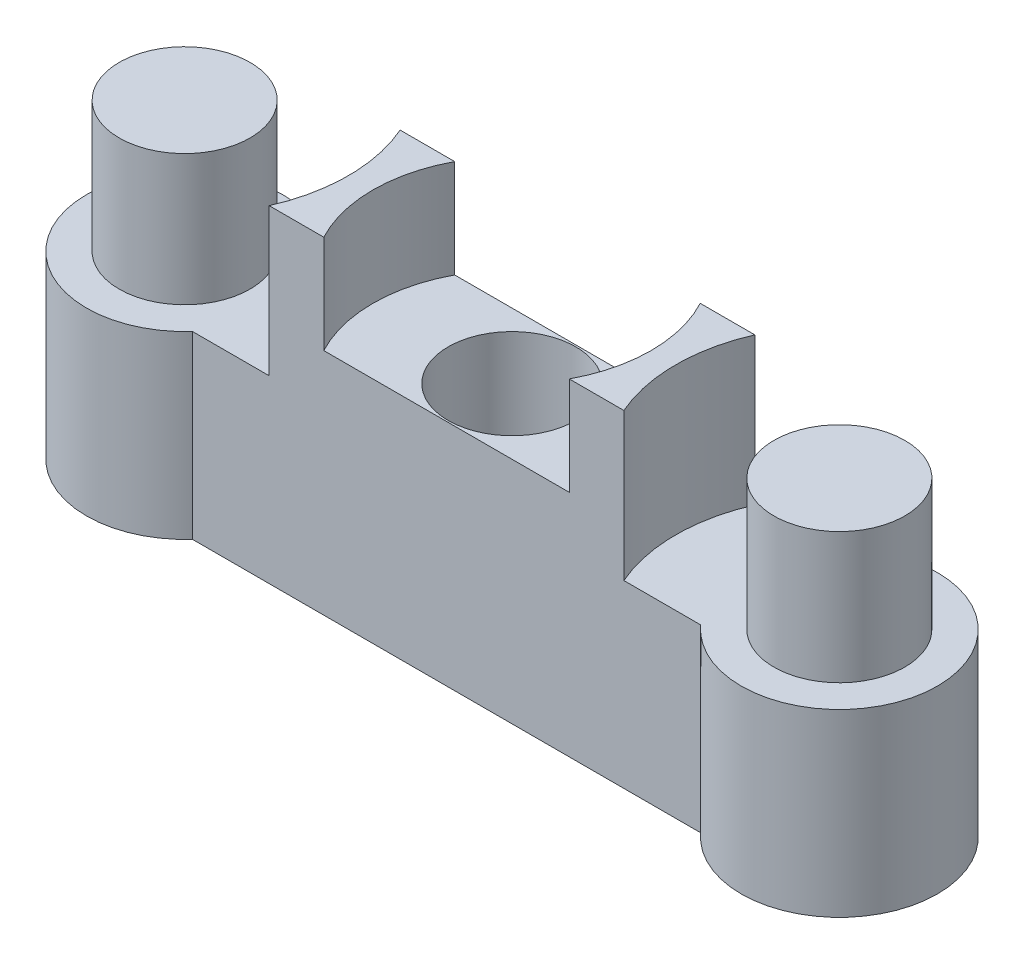
ISO-10303-21;
HEADER;
FILE_DESCRIPTION(('STEP AP214'),'2;1');
FILE_NAME('part.step','',(''),(''),'','','');
FILE_SCHEMA(('AUTOMOTIVE_DESIGN { 1 0 10303 214 1 1 1 1 }'));
ENDSEC;
DATA;
#1=APPLICATION_CONTEXT('core data for automotive mechanical design processes');
#2=APPLICATION_PROTOCOL_DEFINITION('international standard','automotive_design',2000,#1);
#3=PRODUCT_CONTEXT('',#1,'mechanical');
#4=PRODUCT('Part','Part','',(#3));
#5=PRODUCT_RELATED_PRODUCT_CATEGORY('part','',(#4));
#6=PRODUCT_DEFINITION_FORMATION('','',#4);
#7=PRODUCT_DEFINITION_CONTEXT('part definition',#1,'design');
#8=PRODUCT_DEFINITION('design','',#6,#7);
#9=PRODUCT_DEFINITION_SHAPE('','',#8);
#10=(LENGTH_UNIT() NAMED_UNIT(*) SI_UNIT(.MILLI.,.METRE.));
#11=(NAMED_UNIT(*) PLANE_ANGLE_UNIT() SI_UNIT($,.RADIAN.));
#12=(NAMED_UNIT(*) SI_UNIT($,.STERADIAN.) SOLID_ANGLE_UNIT());
#13=UNCERTAINTY_MEASURE_WITH_UNIT(LENGTH_MEASURE(1.E-05),#10,'distance_accuracy_value','');
#14=(GEOMETRIC_REPRESENTATION_CONTEXT(3) GLOBAL_UNCERTAINTY_ASSIGNED_CONTEXT((#13)) GLOBAL_UNIT_ASSIGNED_CONTEXT((#10,
#11,#12)) REPRESENTATION_CONTEXT('',''));
#15=CARTESIAN_POINT('',(0.,0.,0.));
#16=DIRECTION('',(0.,0.,1.));
#17=DIRECTION('',(1.,0.,0.));
#18=AXIS2_PLACEMENT_3D('',#15,#16,#17);
#19=CARTESIAN_POINT('',(-10.,10.,0.));
#20=DIRECTION('',(0.,1.,0.));
#21=DIRECTION('',(0.,0.,1.));
#22=AXIS2_PLACEMENT_3D('',#19,#20,#21);
#23=PLANE('',#22);
#24=CARTESIAN_POINT('',(0.,10.,0.));
#25=DIRECTION('',(0.,1.,0.));
#26=DIRECTION('',(0.,0.,1.));
#27=AXIS2_PLACEMENT_3D('',#24,#25,#26);
#28=CIRCLE('',#27,4.25);
#29=CARTESIAN_POINT('',(3.75,10.,2.));
#30=VERTEX_POINT('',#29);
#31=CARTESIAN_POINT('',(3.75,10.,-2.));
#32=VERTEX_POINT('',#31);
#33=EDGE_CURVE('E133',#30,#32,#28,.T.);
#34=ORIENTED_EDGE('',*,*,#33,.F.);
#35=DIRECTION('',(1.,0.,0.));
#36=VECTOR('',#35,1.);
#37=CARTESIAN_POINT('',(7.76393202250021,10.,2.));
#38=LINE('',#37,#36);
#39=CARTESIAN_POINT('',(5.41742430504417,10.,2.));
#40=VERTEX_POINT('',#39);
#41=EDGE_CURVE('E145',#30,#40,#38,.T.);
#42=ORIENTED_EDGE('',*,*,#41,.T.);
#43=CARTESIAN_POINT('',(10.,10.,0.));
#44=DIRECTION('',(0.,1.,0.));
#45=DIRECTION('',(0.,0.,-1.));
#46=AXIS2_PLACEMENT_3D('',#43,#44,#45);
#47=CIRCLE('',#46,5.);
#48=CARTESIAN_POINT('',(5.41742430504416,10.,-2.));
#49=VERTEX_POINT('',#48);
#50=EDGE_CURVE('E209',#49,#40,#47,.T.);
#51=ORIENTED_EDGE('',*,*,#50,.F.);
#52=DIRECTION('',(-1.,0.,0.));
#53=VECTOR('',#52,1.);
#54=CARTESIAN_POINT('',(7.76393202250021,10.,-2.));
#55=LINE('',#54,#53);
#56=EDGE_CURVE('E147',#49,#32,#55,.T.);
#57=ORIENTED_EDGE('',*,*,#56,.T.);
#58=EDGE_LOOP('',(#34,#42,#51,#57));
#59=FACE_BOUND('',#58,.T.);
#60=ADVANCED_FACE('F36',(#59),#23,.T.);
#61=CARTESIAN_POINT('',(0.,2.,0.));
#62=DIRECTION('',(0.,1.,0.));
#63=DIRECTION('',(0.,0.,1.));
#64=AXIS2_PLACEMENT_3D('',#61,#62,#63);
#65=CYLINDRICAL_SURFACE('',#64,1.95);
#66=CARTESIAN_POINT('',(0.,2.,0.));
#67=DIRECTION('',(0.,1.,0.));
#68=DIRECTION('',(0.,0.,1.));
#69=AXIS2_PLACEMENT_3D('',#66,#67,#68);
#70=CIRCLE('',#69,1.95);
#71=CARTESIAN_POINT('',(0.,2.,1.95));
#72=VERTEX_POINT('',#71);
#73=EDGE_CURVE('E190',#72,#72,#70,.T.);
#74=ORIENTED_EDGE('',*,*,#73,.F.);
#75=EDGE_LOOP('',(#74));
#76=FACE_BOUND('',#75,.T.);
#77=CARTESIAN_POINT('',(0.,7.,0.));
#78=DIRECTION('',(0.,1.,0.));
#79=DIRECTION('',(0.,0.,1.));
#80=AXIS2_PLACEMENT_3D('',#77,#78,#79);
#81=CIRCLE('',#80,1.95);
#82=CARTESIAN_POINT('',(0.,7.,1.95));
#83=VERTEX_POINT('',#82);
#84=EDGE_CURVE('E40',#83,#83,#81,.F.);
#85=ORIENTED_EDGE('',*,*,#84,.F.);
#86=EDGE_LOOP('',(#85));
#87=FACE_BOUND('',#86,.T.);
#88=ADVANCED_FACE('F290',(#76,#87),#65,.F.);
#89=CARTESIAN_POINT('',(0.,0.,0.));
#90=DIRECTION('',(0.,1.,0.));
#91=DIRECTION('',(0.,0.,1.));
#92=AXIS2_PLACEMENT_3D('',#89,#90,#91);
#93=CYLINDRICAL_SURFACE('',#92,1.);
#94=CARTESIAN_POINT('',(0.,0.,0.));
#95=DIRECTION('',(0.,1.,0.));
#96=DIRECTION('',(0.,0.,1.));
#97=AXIS2_PLACEMENT_3D('',#94,#95,#96);
#98=CIRCLE('',#97,1.);
#99=CARTESIAN_POINT('',(0.,0.,1.));
#100=VERTEX_POINT('',#99);
#101=EDGE_CURVE('E189',#100,#100,#98,.T.);
#102=ORIENTED_EDGE('',*,*,#101,.F.);
#103=EDGE_LOOP('',(#102));
#104=FACE_BOUND('',#103,.T.);
#105=CARTESIAN_POINT('',(0.,2.,0.));
#106=DIRECTION('',(0.,1.,0.));
#107=DIRECTION('',(0.,0.,1.));
#108=AXIS2_PLACEMENT_3D('',#105,#106,#107);
#109=CIRCLE('',#108,1.);
#110=CARTESIAN_POINT('',(0.,2.,1.));
#111=VERTEX_POINT('',#110);
#112=EDGE_CURVE('E187',#111,#111,#109,.F.);
#113=ORIENTED_EDGE('',*,*,#112,.F.);
#114=EDGE_LOOP('',(#113));
#115=FACE_BOUND('',#114,.T.);
#116=ADVANCED_FACE('F295',(#104,#115),#93,.F.);
#117=CARTESIAN_POINT('',(-10.,10.,0.));
#118=DIRECTION('',(0.,-1.,0.));
#119=DIRECTION('',(0.,0.,-1.));
#120=AXIS2_PLACEMENT_3D('',#117,#118,#119);
#121=CYLINDRICAL_SURFACE('',#120,3.);
#122=CARTESIAN_POINT('',(-10.,5.5,0.));
#123=DIRECTION('',(0.,1.,0.));
#124=DIRECTION('',(0.,0.,1.));
#125=AXIS2_PLACEMENT_3D('',#122,#123,#124);
#126=CIRCLE('',#125,3.);
#127=CARTESIAN_POINT('',(-7.76393202250021,5.5,-2.));
#128=VERTEX_POINT('',#127);
#129=CARTESIAN_POINT('',(-7.76393202250021,5.5,2.));
#130=VERTEX_POINT('',#129);
#131=EDGE_CURVE('E234',#128,#130,#126,.T.);
#132=ORIENTED_EDGE('',*,*,#131,.F.);
#133=DIRECTION('',(0.,-1.,0.));
#134=VECTOR('',#133,1.);
#135=CARTESIAN_POINT('',(-7.76393202250021,10.,-2.));
#136=LINE('',#135,#134);
#137=CARTESIAN_POINT('',(-7.76393202250021,0.,-2.));
#138=VERTEX_POINT('',#137);
#139=EDGE_CURVE('E168',#128,#138,#136,.T.);
#140=ORIENTED_EDGE('',*,*,#139,.T.);
#141=CARTESIAN_POINT('',(-10.,0.,0.));
#142=DIRECTION('',(0.,1.,0.));
#143=DIRECTION('',(0.,0.,1.));
#144=AXIS2_PLACEMENT_3D('',#141,#142,#143);
#145=CIRCLE('',#144,3.);
#146=CARTESIAN_POINT('',(-7.76393202250021,0.,2.));
#147=VERTEX_POINT('',#146);
#148=EDGE_CURVE('E169',#138,#147,#145,.T.);
#149=ORIENTED_EDGE('',*,*,#148,.T.);
#150=DIRECTION('',(0.,-1.,0.));
#151=VECTOR('',#150,1.);
#152=CARTESIAN_POINT('',(-7.76393202250021,10.,2.));
#153=LINE('',#152,#151);
#154=EDGE_CURVE('E182',#130,#147,#153,.T.);
#155=ORIENTED_EDGE('',*,*,#154,.F.);
#156=EDGE_LOOP('',(#132,#140,#149,#155));
#157=FACE_BOUND('',#156,.T.);
#158=ADVANCED_FACE('F38',(#157),#121,.T.);
#159=CARTESIAN_POINT('',(7.76393202250021,10.,2.));
#160=DIRECTION('',(0.,0.,-1.));
#161=DIRECTION('',(-1.,0.,0.));
#162=AXIS2_PLACEMENT_3D('',#159,#160,#161);
#163=PLANE('',#162);
#164=DIRECTION('',(1.,0.,0.));
#165=VECTOR('',#164,1.);
#166=CARTESIAN_POINT('',(7.76393202250021,7.,2.));
#167=LINE('',#166,#165);
#168=CARTESIAN_POINT('',(-3.75,7.,2.));
#169=VERTEX_POINT('',#168);
#170=CARTESIAN_POINT('',(3.75,7.,2.));
#171=VERTEX_POINT('',#170);
#172=EDGE_CURVE('E269',#169,#171,#167,.T.);
#173=ORIENTED_EDGE('',*,*,#172,.F.);
#174=DIRECTION('',(0.,1.,0.));
#175=VECTOR('',#174,1.);
#176=CARTESIAN_POINT('',(-3.75,7.,2.));
#177=LINE('',#176,#175);
#178=CARTESIAN_POINT('',(-3.75,10.,2.));
#179=VERTEX_POINT('',#178);
#180=EDGE_CURVE('E140',#169,#179,#177,.T.);
#181=ORIENTED_EDGE('',*,*,#180,.T.);
#182=CARTESIAN_POINT('',(-5.41742430504416,10.,2.));
#183=VERTEX_POINT('',#182);
#184=EDGE_CURVE('E155',#183,#179,#38,.T.);
#185=ORIENTED_EDGE('',*,*,#184,.F.);
#186=DIRECTION('',(0.,1.,0.));
#187=VECTOR('',#186,1.);
#188=CARTESIAN_POINT('',(-5.41742430504416,5.5,2.));
#189=LINE('',#188,#187);
#190=CARTESIAN_POINT('',(-5.41742430504416,5.5,2.));
#191=VERTEX_POINT('',#190);
#192=EDGE_CURVE('E227',#183,#191,#189,.F.);
#193=ORIENTED_EDGE('',*,*,#192,.T.);
#194=DIRECTION('',(1.,0.,0.));
#195=VECTOR('',#194,1.);
#196=CARTESIAN_POINT('',(7.76393202250021,5.5,2.));
#197=LINE('',#196,#195);
#198=EDGE_CURVE('E165',#130,#191,#197,.T.);
#199=ORIENTED_EDGE('',*,*,#198,.F.);
#200=ORIENTED_EDGE('',*,*,#154,.T.);
#201=DIRECTION('',(1.,0.,0.));
#202=VECTOR('',#201,1.);
#203=CARTESIAN_POINT('',(7.76393202250021,0.,2.));
#204=LINE('',#203,#202);
#205=CARTESIAN_POINT('',(7.76393202250021,0.,2.));
#206=VERTEX_POINT('',#205);
#207=EDGE_CURVE('E172',#147,#206,#204,.T.);
#208=ORIENTED_EDGE('',*,*,#207,.T.);
#209=DIRECTION('',(0.,-1.,0.));
#210=VECTOR('',#209,1.);
#211=CARTESIAN_POINT('',(7.76393202250021,10.,2.));
#212=LINE('',#211,#210);
#213=CARTESIAN_POINT('',(7.76393202250021,5.5,2.));
#214=VERTEX_POINT('',#213);
#215=EDGE_CURVE('E180',#214,#206,#212,.T.);
#216=ORIENTED_EDGE('',*,*,#215,.F.);
#217=DIRECTION('',(-1.,0.,0.));
#218=VECTOR('',#217,1.);
#219=CARTESIAN_POINT('',(7.76393202250021,5.5,2.));
#220=LINE('',#219,#218);
#221=CARTESIAN_POINT('',(5.41742430504417,5.5,2.));
#222=VERTEX_POINT('',#221);
#223=EDGE_CURVE('E233',#214,#222,#220,.T.);
#224=ORIENTED_EDGE('',*,*,#223,.T.);
#225=DIRECTION('',(0.,1.,0.));
#226=VECTOR('',#225,1.);
#227=CARTESIAN_POINT('',(5.41742430504417,5.5,2.));
#228=LINE('',#227,#226);
#229=EDGE_CURVE('E154',#222,#40,#228,.T.);
#230=ORIENTED_EDGE('',*,*,#229,.T.);
#231=ORIENTED_EDGE('',*,*,#41,.F.);
#232=DIRECTION('',(0.,1.,0.));
#233=VECTOR('',#232,1.);
#234=CARTESIAN_POINT('',(3.75,7.,2.));
#235=LINE('',#234,#233);
#236=EDGE_CURVE('E130',#30,#171,#235,.F.);
#237=ORIENTED_EDGE('',*,*,#236,.T.);
#238=EDGE_LOOP('',(#173,#181,#185,#193,#199,#200,#208,#216,#224,#230,#231,#237));
#239=FACE_BOUND('',#238,.T.);
#240=ADVANCED_FACE('F152',(#239),#163,.F.);
#241=CARTESIAN_POINT('',(10.,10.,0.));
#242=DIRECTION('',(0.,-1.,0.));
#243=DIRECTION('',(0.,0.,-1.));
#244=AXIS2_PLACEMENT_3D('',#241,#242,#243);
#245=CYLINDRICAL_SURFACE('',#244,3.);
#246=DIRECTION('',(0.,-1.,0.));
#247=VECTOR('',#246,1.);
#248=CARTESIAN_POINT('',(7.76393202250021,10.,-2.));
#249=LINE('',#248,#247);
#250=CARTESIAN_POINT('',(7.76393202250021,5.5,-2.));
#251=VERTEX_POINT('',#250);
#252=CARTESIAN_POINT('',(7.76393202250021,0.,-2.));
#253=VERTEX_POINT('',#252);
#254=EDGE_CURVE('E178',#251,#253,#249,.T.);
#255=ORIENTED_EDGE('',*,*,#254,.F.);
#256=CARTESIAN_POINT('',(10.,5.5,0.));
#257=DIRECTION('',(0.,-1.,0.));
#258=DIRECTION('',(0.,0.,-1.));
#259=AXIS2_PLACEMENT_3D('',#256,#257,#258);
#260=CIRCLE('',#259,3.);
#261=EDGE_CURVE('E230',#251,#214,#260,.T.);
#262=ORIENTED_EDGE('',*,*,#261,.T.);
#263=ORIENTED_EDGE('',*,*,#215,.T.);
#264=CARTESIAN_POINT('',(10.,0.,0.));
#265=DIRECTION('',(0.,1.,0.));
#266=DIRECTION('',(0.,0.,-1.));
#267=AXIS2_PLACEMENT_3D('',#264,#265,#266);
#268=CIRCLE('',#267,3.);
#269=EDGE_CURVE('E161',#206,#253,#268,.T.);
#270=ORIENTED_EDGE('',*,*,#269,.T.);
#271=EDGE_LOOP('',(#255,#262,#263,#270));
#272=FACE_BOUND('',#271,.T.);
#273=ADVANCED_FACE('F263',(#272),#245,.T.);
#274=CARTESIAN_POINT('',(7.76393202250021,10.,-2.));
#275=DIRECTION('',(0.,0.,1.));
#276=DIRECTION('',(1.,0.,0.));
#277=AXIS2_PLACEMENT_3D('',#274,#275,#276);
#278=PLANE('',#277);
#279=DIRECTION('',(-1.,0.,0.));
#280=VECTOR('',#279,1.);
#281=CARTESIAN_POINT('',(7.76393202250021,7.,-2.));
#282=LINE('',#281,#280);
#283=CARTESIAN_POINT('',(3.75,7.,-2.));
#284=VERTEX_POINT('',#283);
#285=CARTESIAN_POINT('',(-3.75,7.,-2.));
#286=VERTEX_POINT('',#285);
#287=EDGE_CURVE('E267',#284,#286,#282,.T.);
#288=ORIENTED_EDGE('',*,*,#287,.F.);
#289=DIRECTION('',(0.,1.,0.));
#290=VECTOR('',#289,1.);
#291=CARTESIAN_POINT('',(3.75,7.,-2.));
#292=LINE('',#291,#290);
#293=EDGE_CURVE('E141',#284,#32,#292,.T.);
#294=ORIENTED_EDGE('',*,*,#293,.T.);
#295=ORIENTED_EDGE('',*,*,#56,.F.);
#296=DIRECTION('',(0.,1.,0.));
#297=VECTOR('',#296,1.);
#298=CARTESIAN_POINT('',(5.41742430504416,5.5,-2.));
#299=LINE('',#298,#297);
#300=CARTESIAN_POINT('',(5.41742430504416,5.5,-2.));
#301=VERTEX_POINT('',#300);
#302=EDGE_CURVE('E61',#49,#301,#299,.F.);
#303=ORIENTED_EDGE('',*,*,#302,.T.);
#304=DIRECTION('',(1.,0.,0.));
#305=VECTOR('',#304,1.);
#306=CARTESIAN_POINT('',(7.76393202250021,5.5,-2.));
#307=LINE('',#306,#305);
#308=EDGE_CURVE('E184',#301,#251,#307,.T.);
#309=ORIENTED_EDGE('',*,*,#308,.T.);
#310=ORIENTED_EDGE('',*,*,#254,.T.);
#311=DIRECTION('',(-1.,0.,0.));
#312=VECTOR('',#311,1.);
#313=CARTESIAN_POINT('',(7.76393202250021,0.,-2.));
#314=LINE('',#313,#312);
#315=EDGE_CURVE('E156',#253,#138,#314,.T.);
#316=ORIENTED_EDGE('',*,*,#315,.T.);
#317=ORIENTED_EDGE('',*,*,#139,.F.);
#318=DIRECTION('',(-1.,0.,0.));
#319=VECTOR('',#318,1.);
#320=CARTESIAN_POINT('',(7.76393202250021,5.5,-2.));
#321=LINE('',#320,#319);
#322=CARTESIAN_POINT('',(-5.41742430504416,5.5,-2.));
#323=VERTEX_POINT('',#322);
#324=EDGE_CURVE('E45',#323,#128,#321,.T.);
#325=ORIENTED_EDGE('',*,*,#324,.F.);
#326=DIRECTION('',(0.,1.,0.));
#327=VECTOR('',#326,1.);
#328=CARTESIAN_POINT('',(-5.41742430504416,5.5,-2.));
#329=LINE('',#328,#327);
#330=CARTESIAN_POINT('',(-5.41742430504416,10.,-2.));
#331=VERTEX_POINT('',#330);
#332=EDGE_CURVE('E224',#323,#331,#329,.T.);
#333=ORIENTED_EDGE('',*,*,#332,.T.);
#334=CARTESIAN_POINT('',(-3.75,10.,-2.));
#335=VERTEX_POINT('',#334);
#336=EDGE_CURVE('E159',#335,#331,#55,.T.);
#337=ORIENTED_EDGE('',*,*,#336,.F.);
#338=DIRECTION('',(0.,1.,0.));
#339=VECTOR('',#338,1.);
#340=CARTESIAN_POINT('',(-3.75,7.,-2.));
#341=LINE('',#340,#339);
#342=EDGE_CURVE('E53',#335,#286,#341,.F.);
#343=ORIENTED_EDGE('',*,*,#342,.T.);
#344=EDGE_LOOP('',(#288,#294,#295,#303,#309,#310,#316,#317,#325,#333,#337,#343));
#345=FACE_BOUND('',#344,.T.);
#346=ADVANCED_FACE('F251',(#345),#278,.F.);
#347=EDGE_CURVE('E149',#335,#179,#28,.T.);
#348=ORIENTED_EDGE('',*,*,#347,.F.);
#349=ORIENTED_EDGE('',*,*,#336,.T.);
#350=CARTESIAN_POINT('',(-10.,10.,0.));
#351=DIRECTION('',(0.,1.,0.));
#352=DIRECTION('',(0.,0.,1.));
#353=AXIS2_PLACEMENT_3D('',#350,#351,#352);
#354=CIRCLE('',#353,5.);
#355=EDGE_CURVE('E215',#183,#331,#354,.T.);
#356=ORIENTED_EDGE('',*,*,#355,.F.);
#357=ORIENTED_EDGE('',*,*,#184,.T.);
#358=EDGE_LOOP('',(#348,#349,#356,#357));
#359=FACE_BOUND('',#358,.T.);
#360=ADVANCED_FACE('F247',(#359),#23,.T.);
#361=CARTESIAN_POINT('',(-10.,0.,0.));
#362=DIRECTION('',(0.,1.,0.));
#363=DIRECTION('',(0.,0.,1.));
#364=AXIS2_PLACEMENT_3D('',#361,#362,#363);
#365=PLANE('',#364);
#366=ORIENTED_EDGE('',*,*,#101,.T.);
#367=EDGE_LOOP('',(#366));
#368=FACE_BOUND('',#367,.T.);
#369=ORIENTED_EDGE('',*,*,#148,.F.);
#370=ORIENTED_EDGE('',*,*,#315,.F.);
#371=ORIENTED_EDGE('',*,*,#269,.F.);
#372=ORIENTED_EDGE('',*,*,#207,.F.);
#373=EDGE_LOOP('',(#369,#370,#371,#372));
#374=FACE_BOUND('',#373,.T.);
#375=ADVANCED_FACE('F259',(#368,#374),#365,.F.);
#376=CARTESIAN_POINT('',(10.,5.5,0.));
#377=DIRECTION('',(0.,-1.,0.));
#378=DIRECTION('',(0.,0.,-1.));
#379=AXIS2_PLACEMENT_3D('',#376,#377,#378);
#380=PLANE('',#379);
#381=CARTESIAN_POINT('',(10.,5.5,0.));
#382=DIRECTION('',(0.,-1.,0.));
#383=DIRECTION('',(0.,0.,-1.));
#384=AXIS2_PLACEMENT_3D('',#381,#382,#383);
#385=CIRCLE('',#384,2.);
#386=CARTESIAN_POINT('',(10.,5.5,-2.));
#387=VERTEX_POINT('',#386);
#388=EDGE_CURVE('E11',#387,#387,#385,.F.);
#389=ORIENTED_EDGE('',*,*,#388,.F.);
#390=EDGE_LOOP('',(#389));
#391=FACE_BOUND('',#390,.T.);
#392=ORIENTED_EDGE('',*,*,#261,.F.);
#393=ORIENTED_EDGE('',*,*,#308,.F.);
#394=CARTESIAN_POINT('',(10.,5.5,0.));
#395=DIRECTION('',(0.,1.,0.));
#396=DIRECTION('',(0.,0.,-1.));
#397=AXIS2_PLACEMENT_3D('',#394,#395,#396);
#398=CIRCLE('',#397,5.);
#399=EDGE_CURVE('E218',#301,#222,#398,.T.);
#400=ORIENTED_EDGE('',*,*,#399,.T.);
#401=ORIENTED_EDGE('',*,*,#223,.F.);
#402=EDGE_LOOP('',(#392,#393,#400,#401));
#403=FACE_BOUND('',#402,.T.);
#404=ADVANCED_FACE('F265',(#391,#403),#380,.F.);
#405=CARTESIAN_POINT('',(10.,5.5,0.));
#406=DIRECTION('',(0.,1.,0.));
#407=DIRECTION('',(0.,0.,1.));
#408=AXIS2_PLACEMENT_3D('',#405,#406,#407);
#409=CYLINDRICAL_SURFACE('',#408,5.);
#410=ORIENTED_EDGE('',*,*,#399,.F.);
#411=ORIENTED_EDGE('',*,*,#302,.F.);
#412=ORIENTED_EDGE('',*,*,#50,.T.);
#413=ORIENTED_EDGE('',*,*,#229,.F.);
#414=EDGE_LOOP('',(#410,#411,#412,#413));
#415=FACE_BOUND('',#414,.T.);
#416=ADVANCED_FACE('F266',(#415),#409,.F.);
#417=CARTESIAN_POINT('',(-10.,5.5,0.));
#418=DIRECTION('',(0.,1.,0.));
#419=DIRECTION('',(0.,0.,1.));
#420=AXIS2_PLACEMENT_3D('',#417,#418,#419);
#421=PLANE('',#420);
#422=CARTESIAN_POINT('',(-10.,5.5,0.));
#423=DIRECTION('',(0.,1.,0.));
#424=DIRECTION('',(0.,0.,1.));
#425=AXIS2_PLACEMENT_3D('',#422,#423,#424);
#426=CIRCLE('',#425,2.);
#427=CARTESIAN_POINT('',(-10.,5.5,2.));
#428=VERTEX_POINT('',#427);
#429=EDGE_CURVE('E205',#428,#428,#426,.T.);
#430=ORIENTED_EDGE('',*,*,#429,.F.);
#431=EDGE_LOOP('',(#430));
#432=FACE_BOUND('',#431,.T.);
#433=ORIENTED_EDGE('',*,*,#198,.T.);
#434=CARTESIAN_POINT('',(-10.,5.5,0.));
#435=DIRECTION('',(0.,1.,0.));
#436=DIRECTION('',(0.,0.,1.));
#437=AXIS2_PLACEMENT_3D('',#434,#435,#436);
#438=CIRCLE('',#437,5.);
#439=EDGE_CURVE('E212',#191,#323,#438,.T.);
#440=ORIENTED_EDGE('',*,*,#439,.T.);
#441=ORIENTED_EDGE('',*,*,#324,.T.);
#442=ORIENTED_EDGE('',*,*,#131,.T.);
#443=EDGE_LOOP('',(#433,#440,#441,#442));
#444=FACE_BOUND('',#443,.T.);
#445=ADVANCED_FACE('F239',(#432,#444),#421,.T.);
#446=CARTESIAN_POINT('',(-10.,5.5,0.));
#447=DIRECTION('',(0.,1.,0.));
#448=DIRECTION('',(0.,0.,1.));
#449=AXIS2_PLACEMENT_3D('',#446,#447,#448);
#450=CYLINDRICAL_SURFACE('',#449,5.);
#451=ORIENTED_EDGE('',*,*,#355,.T.);
#452=ORIENTED_EDGE('',*,*,#332,.F.);
#453=ORIENTED_EDGE('',*,*,#439,.F.);
#454=ORIENTED_EDGE('',*,*,#192,.F.);
#455=EDGE_LOOP('',(#451,#452,#453,#454));
#456=FACE_BOUND('',#455,.T.);
#457=ADVANCED_FACE('F243',(#456),#450,.F.);
#458=CARTESIAN_POINT('',(-10.,9.5,0.));
#459=DIRECTION('',(0.,-1.,0.));
#460=DIRECTION('',(0.,0.,-1.));
#461=AXIS2_PLACEMENT_3D('',#458,#459,#460);
#462=CYLINDRICAL_SURFACE('',#461,2.);
#463=CARTESIAN_POINT('',(-10.,9.5,0.));
#464=DIRECTION('',(0.,1.,0.));
#465=DIRECTION('',(0.,0.,1.));
#466=AXIS2_PLACEMENT_3D('',#463,#464,#465);
#467=CIRCLE('',#466,2.);
#468=CARTESIAN_POINT('',(-10.,9.5,2.));
#469=VERTEX_POINT('',#468);
#470=EDGE_CURVE('E206',#469,#469,#467,.T.);
#471=ORIENTED_EDGE('',*,*,#470,.F.);
#472=EDGE_LOOP('',(#471));
#473=FACE_BOUND('',#472,.T.);
#474=ORIENTED_EDGE('',*,*,#429,.T.);
#475=EDGE_LOOP('',(#474));
#476=FACE_BOUND('',#475,.T.);
#477=ADVANCED_FACE('F335',(#473,#476),#462,.T.);
#478=CARTESIAN_POINT('',(-10.,9.5,0.));
#479=DIRECTION('',(0.,1.,0.));
#480=DIRECTION('',(0.,0.,1.));
#481=AXIS2_PLACEMENT_3D('',#478,#479,#480);
#482=PLANE('',#481);
#483=ORIENTED_EDGE('',*,*,#470,.T.);
#484=EDGE_LOOP('',(#483));
#485=FACE_BOUND('',#484,.T.);
#486=ADVANCED_FACE('F331',(#485),#482,.T.);
#487=CARTESIAN_POINT('',(10.,9.5,0.));
#488=DIRECTION('',(0.,-1.,0.));
#489=DIRECTION('',(0.,0.,-1.));
#490=AXIS2_PLACEMENT_3D('',#487,#488,#489);
#491=CYLINDRICAL_SURFACE('',#490,2.);
#492=CARTESIAN_POINT('',(10.,9.5,0.));
#493=DIRECTION('',(0.,1.,0.));
#494=DIRECTION('',(0.,0.,-1.));
#495=AXIS2_PLACEMENT_3D('',#492,#493,#494);
#496=CIRCLE('',#495,2.);
#497=CARTESIAN_POINT('',(10.,9.5,-2.));
#498=VERTEX_POINT('',#497);
#499=EDGE_CURVE('E194',#498,#498,#496,.T.);
#500=ORIENTED_EDGE('',*,*,#499,.F.);
#501=EDGE_LOOP('',(#500));
#502=FACE_BOUND('',#501,.T.);
#503=ORIENTED_EDGE('',*,*,#388,.T.);
#504=EDGE_LOOP('',(#503));
#505=FACE_BOUND('',#504,.T.);
#506=ADVANCED_FACE('F327',(#502,#505),#491,.T.);
#507=CARTESIAN_POINT('',(10.,9.5,0.));
#508=DIRECTION('',(0.,-1.,0.));
#509=DIRECTION('',(0.,0.,-1.));
#510=AXIS2_PLACEMENT_3D('',#507,#508,#509);
#511=PLANE('',#510);
#512=ORIENTED_EDGE('',*,*,#499,.T.);
#513=EDGE_LOOP('',(#512));
#514=FACE_BOUND('',#513,.T.);
#515=ADVANCED_FACE('F286',(#514),#511,.F.);
#516=CARTESIAN_POINT('',(0.,2.,0.));
#517=DIRECTION('',(0.,1.,0.));
#518=DIRECTION('',(0.,0.,1.));
#519=AXIS2_PLACEMENT_3D('',#516,#517,#518);
#520=PLANE('',#519);
#521=ORIENTED_EDGE('',*,*,#73,.T.);
#522=EDGE_LOOP('',(#521));
#523=FACE_BOUND('',#522,.T.);
#524=ORIENTED_EDGE('',*,*,#112,.T.);
#525=EDGE_LOOP('',(#524));
#526=FACE_BOUND('',#525,.T.);
#527=ADVANCED_FACE('F280',(#523,#526),#520,.T.);
#528=CARTESIAN_POINT('',(0.,7.,0.));
#529=DIRECTION('',(0.,1.,0.));
#530=DIRECTION('',(0.,0.,1.));
#531=AXIS2_PLACEMENT_3D('',#528,#529,#530);
#532=CYLINDRICAL_SURFACE('',#531,4.25);
#533=CARTESIAN_POINT('',(0.,7.,0.));
#534=DIRECTION('',(0.,1.,0.));
#535=DIRECTION('',(0.,0.,1.));
#536=AXIS2_PLACEMENT_3D('',#533,#534,#535);
#537=CIRCLE('',#536,4.25);
#538=EDGE_CURVE('E148',#286,#169,#537,.T.);
#539=ORIENTED_EDGE('',*,*,#538,.F.);
#540=ORIENTED_EDGE('',*,*,#342,.F.);
#541=ORIENTED_EDGE('',*,*,#347,.T.);
#542=ORIENTED_EDGE('',*,*,#180,.F.);
#543=EDGE_LOOP('',(#539,#540,#541,#542));
#544=FACE_BOUND('',#543,.T.);
#545=ADVANCED_FACE('F278',(#544),#532,.F.);
#546=ORIENTED_EDGE('',*,*,#33,.T.);
#547=ORIENTED_EDGE('',*,*,#293,.F.);
#548=EDGE_CURVE('E136',#171,#284,#537,.T.);
#549=ORIENTED_EDGE('',*,*,#548,.F.);
#550=ORIENTED_EDGE('',*,*,#236,.F.);
#551=EDGE_LOOP('',(#546,#547,#549,#550));
#552=FACE_BOUND('',#551,.T.);
#553=ADVANCED_FACE('F132',(#552),#532,.F.);
#554=CARTESIAN_POINT('',(0.,7.,0.));
#555=DIRECTION('',(0.,1.,0.));
#556=DIRECTION('',(0.,0.,1.));
#557=AXIS2_PLACEMENT_3D('',#554,#555,#556);
#558=PLANE('',#557);
#559=ORIENTED_EDGE('',*,*,#84,.T.);
#560=EDGE_LOOP('',(#559));
#561=FACE_BOUND('',#560,.T.);
#562=ORIENTED_EDGE('',*,*,#172,.T.);
#563=ORIENTED_EDGE('',*,*,#548,.T.);
#564=ORIENTED_EDGE('',*,*,#287,.T.);
#565=ORIENTED_EDGE('',*,*,#538,.T.);
#566=EDGE_LOOP('',(#562,#563,#564,#565));
#567=FACE_BOUND('',#566,.T.);
#568=ADVANCED_FACE('F277',(#561,#567),#558,.T.);
#569=CLOSED_SHELL('',(#60,#88,#116,#158,#240,#273,#346,#360,#375,#404,#416,#445,#457,#477,#486,
#506,#515,#527,#545,#553,#568));
#570=MANIFOLD_SOLID_BREP('B2',#569);
#571=ADVANCED_BREP_SHAPE_REPRESENTATION('',(#18,#570),#14);
#572=SHAPE_DEFINITION_REPRESENTATION(#9,#571);
ENDSEC;
END-ISO-10303-21;
